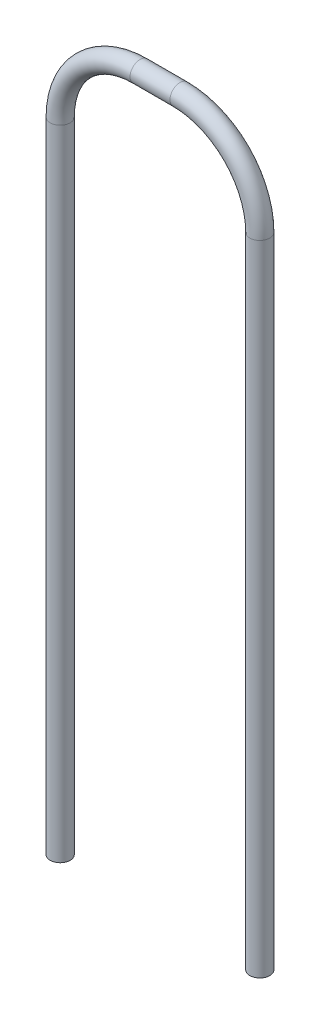
ISO-10303-21;
HEADER;
FILE_DESCRIPTION(('STEP AP214'),'2;1');
FILE_NAME('part.step','',(''),(''),'','','');
FILE_SCHEMA(('AUTOMOTIVE_DESIGN { 1 0 10303 214 1 1 1 1 }'));
ENDSEC;
DATA;
#1=APPLICATION_CONTEXT('core data for automotive mechanical design processes');
#2=APPLICATION_PROTOCOL_DEFINITION('international standard','automotive_design',2000,#1);
#3=PRODUCT_CONTEXT('',#1,'mechanical');
#4=PRODUCT('Part','Part','',(#3));
#5=PRODUCT_RELATED_PRODUCT_CATEGORY('part','',(#4));
#6=PRODUCT_DEFINITION_FORMATION('','',#4);
#7=PRODUCT_DEFINITION_CONTEXT('part definition',#1,'design');
#8=PRODUCT_DEFINITION('design','',#6,#7);
#9=PRODUCT_DEFINITION_SHAPE('','',#8);
#10=(LENGTH_UNIT() NAMED_UNIT(*) SI_UNIT(.MILLI.,.METRE.));
#11=(NAMED_UNIT(*) PLANE_ANGLE_UNIT() SI_UNIT($,.RADIAN.));
#12=(NAMED_UNIT(*) SI_UNIT($,.STERADIAN.) SOLID_ANGLE_UNIT());
#13=UNCERTAINTY_MEASURE_WITH_UNIT(LENGTH_MEASURE(1.E-05),#10,'distance_accuracy_value','');
#14=(GEOMETRIC_REPRESENTATION_CONTEXT(3) GLOBAL_UNCERTAINTY_ASSIGNED_CONTEXT((#13)) GLOBAL_UNIT_ASSIGNED_CONTEXT((#10,
#11,#12)) REPRESENTATION_CONTEXT('',''));
#15=CARTESIAN_POINT('',(0.,0.,0.));
#16=DIRECTION('',(0.,0.,1.));
#17=DIRECTION('',(1.,0.,0.));
#18=AXIS2_PLACEMENT_3D('',#15,#16,#17);
#19=CARTESIAN_POINT('',(-2.49940420657114,0.,0.));
#20=DIRECTION('',(0.,1.,0.));
#21=DIRECTION('',(0.,0.,1.));
#22=AXIS2_PLACEMENT_3D('',#19,#20,#21);
#23=PLANE('',#22);
#24=CARTESIAN_POINT('',(-2.49940420657114,0.,0.));
#25=DIRECTION('',(0.,1.,0.));
#26=DIRECTION('',(0.,0.,1.));
#27=AXIS2_PLACEMENT_3D('',#24,#25,#26);
#28=CIRCLE('',#27,0.25);
#29=CARTESIAN_POINT('',(-2.49940420657114,0.,0.25));
#30=VERTEX_POINT('',#29);
#31=EDGE_CURVE('E64',#30,#30,#28,.T.);
#32=ORIENTED_EDGE('',*,*,#31,.F.);
#33=EDGE_LOOP('',(#32));
#34=FACE_BOUND('',#33,.T.);
#35=ADVANCED_FACE('F37',(#34),#23,.F.);
#36=CARTESIAN_POINT('',(2.50059579342886,0.,0.));
#37=DIRECTION('',(0.,-1.,0.));
#38=DIRECTION('',(0.,0.,1.));
#39=AXIS2_PLACEMENT_3D('',#36,#37,#38);
#40=PLANE('',#39);
#41=CARTESIAN_POINT('',(2.50059579342886,0.,0.));
#42=DIRECTION('',(0.,-1.,0.));
#43=DIRECTION('',(0.,0.,1.));
#44=AXIS2_PLACEMENT_3D('',#41,#42,#43);
#45=CIRCLE('',#44,0.25);
#46=CARTESIAN_POINT('',(2.50059579342886,0.,0.25));
#47=VERTEX_POINT('',#46);
#48=EDGE_CURVE('E10',#47,#47,#45,.T.);
#49=ORIENTED_EDGE('',*,*,#48,.T.);
#50=EDGE_LOOP('',(#49));
#51=FACE_BOUND('',#50,.T.);
#52=ADVANCED_FACE('F72',(#51),#40,.T.);
#53=CARTESIAN_POINT('',(-2.49940420657114,0.,0.));
#54=DIRECTION('',(0.,1.,0.));
#55=DIRECTION('',(0.,0.,1.));
#56=AXIS2_PLACEMENT_3D('',#53,#54,#55);
#57=CYLINDRICAL_SURFACE('',#56,0.25);
#58=CARTESIAN_POINT('',(-2.49940420657114,16.,0.));
#59=DIRECTION('',(0.,1.,0.));
#60=DIRECTION('',(0.,0.,1.));
#61=AXIS2_PLACEMENT_3D('',#58,#59,#60);
#62=CIRCLE('',#61,0.25);
#63=CARTESIAN_POINT('',(-2.74940420657114,16.,0.));
#64=VERTEX_POINT('',#63);
#65=EDGE_CURVE('E60',#64,#64,#62,.T.);
#66=ORIENTED_EDGE('',*,*,#65,.F.);
#67=EDGE_LOOP('',(#66));
#68=FACE_BOUND('',#67,.T.);
#69=ORIENTED_EDGE('',*,*,#31,.T.);
#70=EDGE_LOOP('',(#69));
#71=FACE_BOUND('',#70,.T.);
#72=ADVANCED_FACE('F69',(#68,#71),#57,.T.);
#73=CARTESIAN_POINT('',(-0.499404206571139,16.,0.));
#74=DIRECTION('',(0.,0.,-1.));
#75=DIRECTION('',(-1.,0.,0.));
#76=AXIS2_PLACEMENT_3D('',#73,#74,#75);
#77=TOROIDAL_SURFACE('',#76,2.,0.25);
#78=CARTESIAN_POINT('',(-0.499404206571125,18.,0.));
#79=DIRECTION('',(1.,0.,0.));
#80=DIRECTION('',(0.,0.,1.));
#81=AXIS2_PLACEMENT_3D('',#78,#79,#80);
#82=CIRCLE('',#81,0.25);
#83=CARTESIAN_POINT('',(-0.499404206571123,18.25,0.));
#84=VERTEX_POINT('',#83);
#85=EDGE_CURVE('E54',#84,#84,#82,.T.);
#86=CARTESIAN_POINT('',(-0.499404206571139,16.,0.));
#87=DIRECTION('',(0.,0.,-1.));
#88=DIRECTION('',(-1.,0.,0.));
#89=AXIS2_PLACEMENT_3D('',#86,#87,#88);
#90=CIRCLE('',#89,2.25);
#91=EDGE_CURVE('',#64,#84,#90,.T.);
#92=ORIENTED_EDGE('',*,*,#65,.T.);
#93=ORIENTED_EDGE('',*,*,#85,.F.);
#94=ORIENTED_EDGE('',*,*,#91,.T.);
#95=ORIENTED_EDGE('',*,*,#91,.F.);
#96=EDGE_LOOP('',(#92,#94,#93,#95));
#97=FACE_BOUND('',#96,.T.);
#98=ADVANCED_FACE('F90',(#97),#77,.T.);
#99=CARTESIAN_POINT('',(-0.499404206571125,18.,0.));
#100=DIRECTION('',(1.,0.,0.));
#101=DIRECTION('',(0.,0.,-1.));
#102=AXIS2_PLACEMENT_3D('',#99,#100,#101);
#103=CYLINDRICAL_SURFACE('',#102,0.25);
#104=CARTESIAN_POINT('',(0.500595793428847,18.,0.));
#105=DIRECTION('',(1.,0.,0.));
#106=DIRECTION('',(0.,0.,1.));
#107=AXIS2_PLACEMENT_3D('',#104,#105,#106);
#108=CIRCLE('',#107,0.25);
#109=CARTESIAN_POINT('',(0.500595793428845,18.25,0.));
#110=VERTEX_POINT('',#109);
#111=EDGE_CURVE('E49',#110,#110,#108,.T.);
#112=ORIENTED_EDGE('',*,*,#111,.F.);
#113=EDGE_LOOP('',(#112));
#114=FACE_BOUND('',#113,.T.);
#115=ORIENTED_EDGE('',*,*,#85,.T.);
#116=EDGE_LOOP('',(#115));
#117=FACE_BOUND('',#116,.T.);
#118=ADVANCED_FACE('F84',(#114,#117),#103,.T.);
#119=CARTESIAN_POINT('',(0.500595793428862,16.,0.));
#120=DIRECTION('',(0.,0.,-1.));
#121=DIRECTION('',(-1.,0.,0.));
#122=AXIS2_PLACEMENT_3D('',#119,#120,#121);
#123=TOROIDAL_SURFACE('',#122,2.,0.25);
#124=CARTESIAN_POINT('',(2.50059579342886,16.,0.));
#125=DIRECTION('',(0.,-1.,0.));
#126=DIRECTION('',(0.,0.,1.));
#127=AXIS2_PLACEMENT_3D('',#124,#125,#126);
#128=CIRCLE('',#127,0.25);
#129=CARTESIAN_POINT('',(2.75059579342886,16.,0.));
#130=VERTEX_POINT('',#129);
#131=EDGE_CURVE('E44',#130,#130,#128,.T.);
#132=CARTESIAN_POINT('',(0.500595793428862,16.,0.));
#133=DIRECTION('',(0.,0.,-1.));
#134=DIRECTION('',(-1.,0.,0.));
#135=AXIS2_PLACEMENT_3D('',#132,#133,#134);
#136=CIRCLE('',#135,2.25);
#137=EDGE_CURVE('',#110,#130,#136,.T.);
#138=ORIENTED_EDGE('',*,*,#111,.T.);
#139=ORIENTED_EDGE('',*,*,#131,.F.);
#140=ORIENTED_EDGE('',*,*,#137,.T.);
#141=ORIENTED_EDGE('',*,*,#137,.F.);
#142=EDGE_LOOP('',(#138,#140,#139,#141));
#143=FACE_BOUND('',#142,.T.);
#144=ADVANCED_FACE('F78',(#143),#123,.T.);
#145=CARTESIAN_POINT('',(2.50059579342886,16.,0.));
#146=DIRECTION('',(0.,-1.,0.));
#147=DIRECTION('',(1.,0.,0.));
#148=AXIS2_PLACEMENT_3D('',#145,#146,#147);
#149=CYLINDRICAL_SURFACE('',#148,0.25);
#150=ORIENTED_EDGE('',*,*,#48,.F.);
#151=EDGE_LOOP('',(#150));
#152=FACE_BOUND('',#151,.T.);
#153=ORIENTED_EDGE('',*,*,#131,.T.);
#154=EDGE_LOOP('',(#153));
#155=FACE_BOUND('',#154,.T.);
#156=ADVANCED_FACE('F76',(#152,#155),#149,.T.);
#157=CLOSED_SHELL('',(#35,#52,#72,#98,#118,#144,#156));
#158=MANIFOLD_SOLID_BREP('B2',#157);
#159=ADVANCED_BREP_SHAPE_REPRESENTATION('',(#18,#158),#14);
#160=SHAPE_DEFINITION_REPRESENTATION(#9,#159);
ENDSEC;
END-ISO-10303-21;
